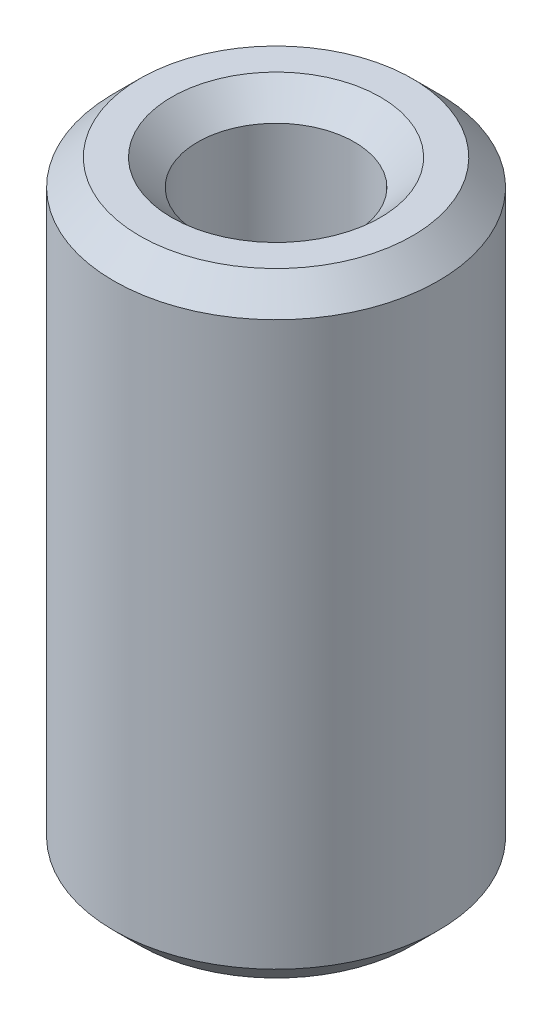
ISO-10303-21;
HEADER;
FILE_DESCRIPTION(('STEP AP214'),'2;1');
FILE_NAME('part.step','',(''),(''),'','','');
FILE_SCHEMA(('AUTOMOTIVE_DESIGN { 1 0 10303 214 1 1 1 1 }'));
ENDSEC;
DATA;
#1=APPLICATION_CONTEXT('core data for automotive mechanical design processes');
#2=APPLICATION_PROTOCOL_DEFINITION('international standard','automotive_design',2000,#1);
#3=PRODUCT_CONTEXT('',#1,'mechanical');
#4=PRODUCT('Part','Part','',(#3));
#5=PRODUCT_RELATED_PRODUCT_CATEGORY('part','',(#4));
#6=PRODUCT_DEFINITION_FORMATION('','',#4);
#7=PRODUCT_DEFINITION_CONTEXT('part definition',#1,'design');
#8=PRODUCT_DEFINITION('design','',#6,#7);
#9=PRODUCT_DEFINITION_SHAPE('','',#8);
#10=(LENGTH_UNIT() NAMED_UNIT(*) SI_UNIT(.MILLI.,.METRE.));
#11=(NAMED_UNIT(*) PLANE_ANGLE_UNIT() SI_UNIT($,.RADIAN.));
#12=(NAMED_UNIT(*) SI_UNIT($,.STERADIAN.) SOLID_ANGLE_UNIT());
#13=UNCERTAINTY_MEASURE_WITH_UNIT(LENGTH_MEASURE(1.E-05),#10,'distance_accuracy_value','');
#14=(GEOMETRIC_REPRESENTATION_CONTEXT(3) GLOBAL_UNCERTAINTY_ASSIGNED_CONTEXT((#13)) GLOBAL_UNIT_ASSIGNED_CONTEXT((#10,
#11,#12)) REPRESENTATION_CONTEXT('',''));
#15=CARTESIAN_POINT('',(0.,0.,0.));
#16=DIRECTION('',(0.,0.,1.));
#17=DIRECTION('',(1.,0.,0.));
#18=AXIS2_PLACEMENT_3D('',#15,#16,#17);
#19=CARTESIAN_POINT('',(0.,37.8666365188487,0.));
#20=DIRECTION('',(0.,-1.,0.));
#21=DIRECTION('',(0.,0.,-1.));
#22=AXIS2_PLACEMENT_3D('',#19,#20,#21);
#23=CYLINDRICAL_SURFACE('',#22,10.);
#24=CARTESIAN_POINT('',(0.,1.60108458844178,0.));
#25=DIRECTION('',(0.,1.,0.));
#26=DIRECTION('',(0.,0.,1.));
#27=AXIS2_PLACEMENT_3D('',#24,#25,#26);
#28=CIRCLE('',#27,10.);
#29=CARTESIAN_POINT('',(0.,1.60108458844178,10.));
#30=VERTEX_POINT('',#29);
#31=EDGE_CURVE('E10',#30,#30,#28,.T.);
#32=ORIENTED_EDGE('',*,*,#31,.T.);
#33=EDGE_LOOP('',(#32));
#34=FACE_BOUND('',#33,.T.);
#35=CARTESIAN_POINT('',(0.,36.2655519304069,0.));
#36=DIRECTION('',(0.,1.,0.));
#37=DIRECTION('',(0.,0.,1.));
#38=AXIS2_PLACEMENT_3D('',#35,#36,#37);
#39=CIRCLE('',#38,10.);
#40=CARTESIAN_POINT('',(0.,36.2655519304069,10.));
#41=VERTEX_POINT('',#40);
#42=EDGE_CURVE('E50',#41,#41,#39,.F.);
#43=ORIENTED_EDGE('',*,*,#42,.T.);
#44=EDGE_LOOP('',(#43));
#45=FACE_BOUND('',#44,.T.);
#46=ADVANCED_FACE('F39',(#34,#45),#23,.T.);
#47=CARTESIAN_POINT('',(0.,37.8666365188487,0.));
#48=DIRECTION('',(0.,1.,0.));
#49=DIRECTION('',(0.,0.,1.));
#50=AXIS2_PLACEMENT_3D('',#47,#48,#49);
#51=PLANE('',#50);
#52=CARTESIAN_POINT('',(0.,37.8666365188487,0.));
#53=DIRECTION('',(0.,1.,0.));
#54=DIRECTION('',(0.,0.,1.));
#55=AXIS2_PLACEMENT_3D('',#52,#53,#54);
#56=CIRCLE('',#55,6.43299181271231);
#57=CARTESIAN_POINT('',(0.,37.8666365188487,6.43299181271231));
#58=VERTEX_POINT('',#57);
#59=EDGE_CURVE('E58',#58,#58,#56,.F.);
#60=ORIENTED_EDGE('',*,*,#59,.T.);
#61=EDGE_LOOP('',(#60));
#62=FACE_BOUND('',#61,.T.);
#63=CARTESIAN_POINT('',(0.,37.8666365188487,0.));
#64=DIRECTION('',(0.,1.,0.));
#65=DIRECTION('',(0.,0.,1.));
#66=AXIS2_PLACEMENT_3D('',#63,#64,#65);
#67=CIRCLE('',#66,8.39891541155823);
#68=CARTESIAN_POINT('',(0.,37.8666365188487,8.39891541155823));
#69=VERTEX_POINT('',#68);
#70=EDGE_CURVE('E61',#69,#69,#67,.T.);
#71=ORIENTED_EDGE('',*,*,#70,.T.);
#72=EDGE_LOOP('',(#71));
#73=FACE_BOUND('',#72,.T.);
#74=ADVANCED_FACE('F88',(#62,#73),#51,.T.);
#75=CARTESIAN_POINT('',(0.,0.,0.));
#76=DIRECTION('',(0.,1.,0.));
#77=DIRECTION('',(0.,0.,1.));
#78=AXIS2_PLACEMENT_3D('',#75,#76,#77);
#79=PLANE('',#78);
#80=CARTESIAN_POINT('',(0.,0.,0.));
#81=DIRECTION('',(0.,1.,0.));
#82=DIRECTION('',(0.,0.,1.));
#83=AXIS2_PLACEMENT_3D('',#80,#81,#82);
#84=CIRCLE('',#83,6.43299181271228);
#85=CARTESIAN_POINT('',(0.,0.,6.43299181271228));
#86=VERTEX_POINT('',#85);
#87=EDGE_CURVE('E51',#86,#86,#84,.T.);
#88=ORIENTED_EDGE('',*,*,#87,.T.);
#89=EDGE_LOOP('',(#88));
#90=FACE_BOUND('',#89,.T.);
#91=CARTESIAN_POINT('',(0.,0.,0.));
#92=DIRECTION('',(0.,1.,0.));
#93=DIRECTION('',(0.,0.,1.));
#94=AXIS2_PLACEMENT_3D('',#91,#92,#93);
#95=CIRCLE('',#94,8.39891541155821);
#96=CARTESIAN_POINT('',(0.,0.,8.39891541155821));
#97=VERTEX_POINT('',#96);
#98=EDGE_CURVE('E54',#97,#97,#95,.F.);
#99=ORIENTED_EDGE('',*,*,#98,.T.);
#100=EDGE_LOOP('',(#99));
#101=FACE_BOUND('',#100,.T.);
#102=ADVANCED_FACE('F83',(#90,#101),#79,.F.);
#103=CARTESIAN_POINT('',(0.,37.8666365188487,0.));
#104=DIRECTION('',(0.,-1.,0.));
#105=DIRECTION('',(0.,0.,-1.));
#106=AXIS2_PLACEMENT_3D('',#103,#104,#105);
#107=CYLINDRICAL_SURFACE('',#106,4.83190722427051);
#108=CARTESIAN_POINT('',(0.,36.2655519304069,0.));
#109=DIRECTION('',(0.,1.,0.));
#110=DIRECTION('',(0.,0.,1.));
#111=AXIS2_PLACEMENT_3D('',#108,#109,#110);
#112=CIRCLE('',#111,4.83190722427051);
#113=CARTESIAN_POINT('',(0.,36.2655519304069,4.83190722427051));
#114=VERTEX_POINT('',#113);
#115=EDGE_CURVE('E67',#114,#114,#112,.T.);
#116=ORIENTED_EDGE('',*,*,#115,.T.);
#117=EDGE_LOOP('',(#116));
#118=FACE_BOUND('',#117,.T.);
#119=CARTESIAN_POINT('',(0.,1.60108458844178,0.));
#120=DIRECTION('',(0.,1.,0.));
#121=DIRECTION('',(0.,0.,1.));
#122=AXIS2_PLACEMENT_3D('',#119,#120,#121);
#123=CIRCLE('',#122,4.83190722427051);
#124=CARTESIAN_POINT('',(0.,1.60108458844178,4.83190722427051));
#125=VERTEX_POINT('',#124);
#126=EDGE_CURVE('E69',#125,#125,#123,.F.);
#127=ORIENTED_EDGE('',*,*,#126,.T.);
#128=EDGE_LOOP('',(#127));
#129=FACE_BOUND('',#128,.T.);
#130=ADVANCED_FACE('F71',(#118,#129),#107,.F.);
#131=CARTESIAN_POINT('',(0.,36.2655519304069,0.));
#132=DIRECTION('',(0.,1.,0.));
#133=DIRECTION('',(0.,0.,1.));
#134=AXIS2_PLACEMENT_3D('',#131,#132,#133);
#135=CONICAL_SURFACE('',#134,4.83190722427051,0.785398163397453);
#136=ORIENTED_EDGE('',*,*,#59,.F.);
#137=EDGE_LOOP('',(#136));
#138=FACE_BOUND('',#137,.T.);
#139=ORIENTED_EDGE('',*,*,#115,.F.);
#140=EDGE_LOOP('',(#139));
#141=FACE_BOUND('',#140,.T.);
#142=ADVANCED_FACE('F77',(#138,#141),#135,.F.);
#143=CARTESIAN_POINT('',(0.,0.,0.));
#144=DIRECTION('',(0.,-1.,0.));
#145=DIRECTION('',(0.,0.,-1.));
#146=AXIS2_PLACEMENT_3D('',#143,#144,#145);
#147=CONICAL_SURFACE('',#146,6.43299181271228,0.785398163397444);
#148=ORIENTED_EDGE('',*,*,#126,.F.);
#149=EDGE_LOOP('',(#148));
#150=FACE_BOUND('',#149,.T.);
#151=ORIENTED_EDGE('',*,*,#87,.F.);
#152=EDGE_LOOP('',(#151));
#153=FACE_BOUND('',#152,.T.);
#154=ADVANCED_FACE('F73',(#150,#153),#147,.F.);
#155=CARTESIAN_POINT('',(0.,1.60108458844178,0.));
#156=DIRECTION('',(0.,1.,0.));
#157=DIRECTION('',(0.,0.,1.));
#158=AXIS2_PLACEMENT_3D('',#155,#156,#157);
#159=CONICAL_SURFACE('',#158,10.,0.785398163397451);
#160=ORIENTED_EDGE('',*,*,#98,.F.);
#161=EDGE_LOOP('',(#160));
#162=FACE_BOUND('',#161,.T.);
#163=ORIENTED_EDGE('',*,*,#31,.F.);
#164=EDGE_LOOP('',(#163));
#165=FACE_BOUND('',#164,.T.);
#166=ADVANCED_FACE('F76',(#162,#165),#159,.T.);
#167=CARTESIAN_POINT('',(0.,37.8666365188487,0.));
#168=DIRECTION('',(0.,-1.,0.));
#169=DIRECTION('',(0.,0.,-1.));
#170=AXIS2_PLACEMENT_3D('',#167,#168,#169);
#171=CONICAL_SURFACE('',#170,8.39891541155823,0.785398163397444);
#172=ORIENTED_EDGE('',*,*,#42,.F.);
#173=EDGE_LOOP('',(#172));
#174=FACE_BOUND('',#173,.T.);
#175=ORIENTED_EDGE('',*,*,#70,.F.);
#176=EDGE_LOOP('',(#175));
#177=FACE_BOUND('',#176,.T.);
#178=ADVANCED_FACE('F45',(#174,#177),#171,.T.);
#179=CLOSED_SHELL('',(#46,#74,#102,#130,#142,#154,#166,#178));
#180=MANIFOLD_SOLID_BREP('B2',#179);
#181=ADVANCED_BREP_SHAPE_REPRESENTATION('',(#18,#180),#14);
#182=SHAPE_DEFINITION_REPRESENTATION(#9,#181);
ENDSEC;
END-ISO-10303-21;
